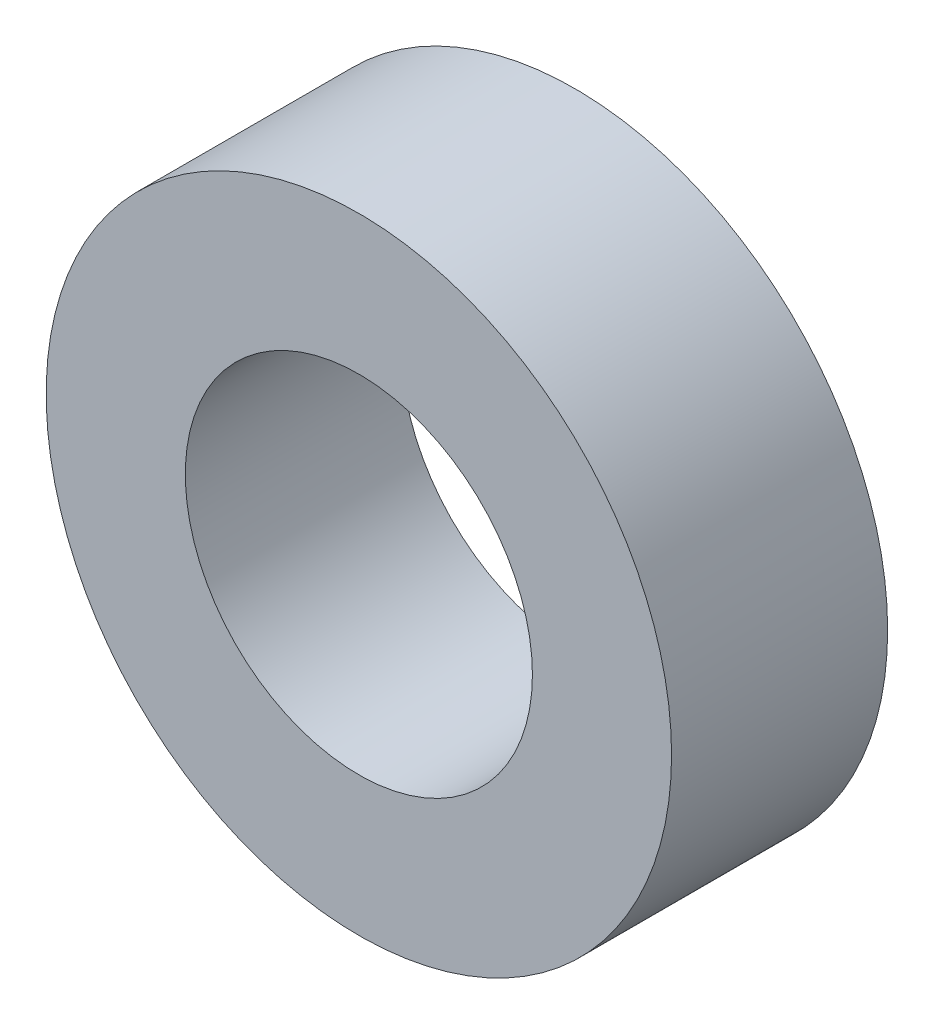
ISO-10303-21;
HEADER;
FILE_DESCRIPTION(('STEP AP214'),'2;1');
FILE_NAME('part.step','',(''),(''),'','','');
FILE_SCHEMA(('AUTOMOTIVE_DESIGN { 1 0 10303 214 1 1 1 1 }'));
ENDSEC;
DATA;
#1=APPLICATION_CONTEXT('core data for automotive mechanical design processes');
#2=APPLICATION_PROTOCOL_DEFINITION('international standard','automotive_design',2000,#1);
#3=PRODUCT_CONTEXT('',#1,'mechanical');
#4=PRODUCT('Part','Part','',(#3));
#5=PRODUCT_RELATED_PRODUCT_CATEGORY('part','',(#4));
#6=PRODUCT_DEFINITION_FORMATION('','',#4);
#7=PRODUCT_DEFINITION_CONTEXT('part definition',#1,'design');
#8=PRODUCT_DEFINITION('design','',#6,#7);
#9=PRODUCT_DEFINITION_SHAPE('','',#8);
#10=(LENGTH_UNIT() NAMED_UNIT(*) SI_UNIT(.MILLI.,.METRE.));
#11=(NAMED_UNIT(*) PLANE_ANGLE_UNIT() SI_UNIT($,.RADIAN.));
#12=(NAMED_UNIT(*) SI_UNIT($,.STERADIAN.) SOLID_ANGLE_UNIT());
#13=UNCERTAINTY_MEASURE_WITH_UNIT(LENGTH_MEASURE(1.E-05),#10,'distance_accuracy_value','');
#14=(GEOMETRIC_REPRESENTATION_CONTEXT(3) GLOBAL_UNCERTAINTY_ASSIGNED_CONTEXT((#13)) GLOBAL_UNIT_ASSIGNED_CONTEXT((#10,
#11,#12)) REPRESENTATION_CONTEXT('',''));
#15=CARTESIAN_POINT('',(0.,0.,0.));
#16=DIRECTION('',(0.,0.,1.));
#17=DIRECTION('',(1.,0.,0.));
#18=AXIS2_PLACEMENT_3D('',#15,#16,#17);
#19=CARTESIAN_POINT('',(11.2986100386091,11.872509652509,6.91));
#20=DIRECTION('',(0.,0.,1.));
#21=DIRECTION('',(1.,0.,0.));
#22=AXIS2_PLACEMENT_3D('',#19,#20,#21);
#23=PLANE('',#22);
#24=CARTESIAN_POINT('',(11.2986100386091,11.872509652509,6.91));
#25=DIRECTION('',(0.,0.,1.));
#26=DIRECTION('',(1.,0.,0.));
#27=AXIS2_PLACEMENT_3D('',#24,#25,#26);
#28=CIRCLE('',#27,9.99999999999953);
#29=CARTESIAN_POINT('',(21.2986100386087,11.872509652509,6.91));
#30=VERTEX_POINT('',#29);
#31=EDGE_CURVE('E10',#30,#30,#28,.T.);
#32=ORIENTED_EDGE('',*,*,#31,.T.);
#33=EDGE_LOOP('',(#32));
#34=FACE_BOUND('',#33,.T.);
#35=CARTESIAN_POINT('',(11.2986100386091,11.872509652509,6.91));
#36=DIRECTION('',(0.,0.,1.));
#37=DIRECTION('',(1.,0.,0.));
#38=AXIS2_PLACEMENT_3D('',#35,#36,#37);
#39=CIRCLE('',#38,5.54999999999985);
#40=CARTESIAN_POINT('',(16.848610038609,11.872509652509,6.91));
#41=VERTEX_POINT('',#40);
#42=EDGE_CURVE('E42',#41,#41,#39,.T.);
#43=ORIENTED_EDGE('',*,*,#42,.F.);
#44=EDGE_LOOP('',(#43));
#45=FACE_BOUND('',#44,.T.);
#46=ADVANCED_FACE('F31',(#34,#45),#23,.T.);
#47=CARTESIAN_POINT('',(11.2986100386091,11.872509652509,0.));
#48=DIRECTION('',(0.,0.,1.));
#49=DIRECTION('',(1.,0.,0.));
#50=AXIS2_PLACEMENT_3D('',#47,#48,#49);
#51=PLANE('',#50);
#52=CARTESIAN_POINT('',(11.2986100386091,11.872509652509,0.));
#53=DIRECTION('',(0.,0.,1.));
#54=DIRECTION('',(1.,0.,0.));
#55=AXIS2_PLACEMENT_3D('',#52,#53,#54);
#56=CIRCLE('',#55,9.99999999999953);
#57=CARTESIAN_POINT('',(21.2986100386087,11.872509652509,0.));
#58=VERTEX_POINT('',#57);
#59=EDGE_CURVE('E35',#58,#58,#56,.T.);
#60=ORIENTED_EDGE('',*,*,#59,.F.);
#61=EDGE_LOOP('',(#60));
#62=FACE_BOUND('',#61,.T.);
#63=CARTESIAN_POINT('',(11.2986100386091,11.872509652509,0.));
#64=DIRECTION('',(0.,0.,1.));
#65=DIRECTION('',(1.,0.,0.));
#66=AXIS2_PLACEMENT_3D('',#63,#64,#65);
#67=CIRCLE('',#66,5.54999999999985);
#68=CARTESIAN_POINT('',(16.848610038609,11.872509652509,0.));
#69=VERTEX_POINT('',#68);
#70=EDGE_CURVE('E44',#69,#69,#67,.T.);
#71=ORIENTED_EDGE('',*,*,#70,.T.);
#72=EDGE_LOOP('',(#71));
#73=FACE_BOUND('',#72,.T.);
#74=ADVANCED_FACE('F54',(#62,#73),#51,.F.);
#75=CARTESIAN_POINT('',(11.2986100386091,11.872509652509,6.91));
#76=DIRECTION('',(0.,0.,-1.));
#77=DIRECTION('',(-1.,0.,0.));
#78=AXIS2_PLACEMENT_3D('',#75,#76,#77);
#79=CYLINDRICAL_SURFACE('',#78,9.99999999999953);
#80=ORIENTED_EDGE('',*,*,#31,.F.);
#81=EDGE_LOOP('',(#80));
#82=FACE_BOUND('',#81,.T.);
#83=ORIENTED_EDGE('',*,*,#59,.T.);
#84=EDGE_LOOP('',(#83));
#85=FACE_BOUND('',#84,.T.);
#86=ADVANCED_FACE('F33',(#82,#85),#79,.T.);
#87=CARTESIAN_POINT('',(11.2986100386091,11.872509652509,6.91));
#88=DIRECTION('',(0.,0.,-1.));
#89=DIRECTION('',(-1.,0.,0.));
#90=AXIS2_PLACEMENT_3D('',#87,#88,#89);
#91=CYLINDRICAL_SURFACE('',#90,5.54999999999985);
#92=ORIENTED_EDGE('',*,*,#42,.T.);
#93=EDGE_LOOP('',(#92));
#94=FACE_BOUND('',#93,.T.);
#95=ORIENTED_EDGE('',*,*,#70,.F.);
#96=EDGE_LOOP('',(#95));
#97=FACE_BOUND('',#96,.T.);
#98=ADVANCED_FACE('F50',(#94,#97),#91,.F.);
#99=CLOSED_SHELL('',(#46,#74,#86,#98));
#100=MANIFOLD_SOLID_BREP('B2',#99);
#101=ADVANCED_BREP_SHAPE_REPRESENTATION('',(#18,#100),#14);
#102=SHAPE_DEFINITION_REPRESENTATION(#9,#101);
ENDSEC;
END-ISO-10303-21;
